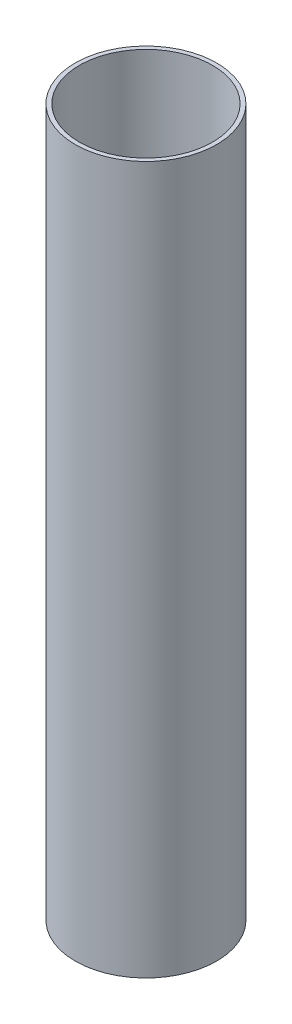
ISO-10303-21;
HEADER;
FILE_DESCRIPTION(('STEP AP214'),'2;1');
FILE_NAME('part.step','',(''),(''),'','','');
FILE_SCHEMA(('AUTOMOTIVE_DESIGN { 1 0 10303 214 1 1 1 1 }'));
ENDSEC;
DATA;
#1=APPLICATION_CONTEXT('core data for automotive mechanical design processes');
#2=APPLICATION_PROTOCOL_DEFINITION('international standard','automotive_design',2000,#1);
#3=PRODUCT_CONTEXT('',#1,'mechanical');
#4=PRODUCT('Part','Part','',(#3));
#5=PRODUCT_RELATED_PRODUCT_CATEGORY('part','',(#4));
#6=PRODUCT_DEFINITION_FORMATION('','',#4);
#7=PRODUCT_DEFINITION_CONTEXT('part definition',#1,'design');
#8=PRODUCT_DEFINITION('design','',#6,#7);
#9=PRODUCT_DEFINITION_SHAPE('','',#8);
#10=(LENGTH_UNIT() NAMED_UNIT(*) SI_UNIT(.MILLI.,.METRE.));
#11=(NAMED_UNIT(*) PLANE_ANGLE_UNIT() SI_UNIT($,.RADIAN.));
#12=(NAMED_UNIT(*) SI_UNIT($,.STERADIAN.) SOLID_ANGLE_UNIT());
#13=UNCERTAINTY_MEASURE_WITH_UNIT(LENGTH_MEASURE(1.E-05),#10,'distance_accuracy_value','');
#14=(GEOMETRIC_REPRESENTATION_CONTEXT(3) GLOBAL_UNCERTAINTY_ASSIGNED_CONTEXT((#13)) GLOBAL_UNIT_ASSIGNED_CONTEXT((#10,
#11,#12)) REPRESENTATION_CONTEXT('',''));
#15=CARTESIAN_POINT('',(0.,0.,0.));
#16=DIRECTION('',(0.,0.,1.));
#17=DIRECTION('',(1.,0.,0.));
#18=AXIS2_PLACEMENT_3D('',#15,#16,#17);
#19=CARTESIAN_POINT('',(0.,0.,0.));
#20=DIRECTION('',(0.,1.,0.));
#21=DIRECTION('',(0.,0.,1.));
#22=AXIS2_PLACEMENT_3D('',#19,#20,#21);
#23=CYLINDRICAL_SURFACE('',#22,6.35);
#24=CARTESIAN_POINT('',(0.,63.5,0.));
#25=DIRECTION('',(0.,1.,0.));
#26=DIRECTION('',(0.,0.,1.));
#27=AXIS2_PLACEMENT_3D('',#24,#25,#26);
#28=CIRCLE('',#27,6.35);
#29=CARTESIAN_POINT('',(0.,63.5,6.35));
#30=VERTEX_POINT('',#29);
#31=EDGE_CURVE('E44',#30,#30,#28,.T.);
#32=ORIENTED_EDGE('',*,*,#31,.F.);
#33=EDGE_LOOP('',(#32));
#34=FACE_BOUND('',#33,.T.);
#35=CARTESIAN_POINT('',(0.,0.,0.));
#36=DIRECTION('',(0.,1.,0.));
#37=DIRECTION('',(0.,0.,1.));
#38=AXIS2_PLACEMENT_3D('',#35,#36,#37);
#39=CIRCLE('',#38,6.35);
#40=CARTESIAN_POINT('',(0.,0.,6.35));
#41=VERTEX_POINT('',#40);
#42=EDGE_CURVE('E35',#41,#41,#39,.T.);
#43=ORIENTED_EDGE('',*,*,#42,.T.);
#44=EDGE_LOOP('',(#43));
#45=FACE_BOUND('',#44,.T.);
#46=ADVANCED_FACE('F32',(#34,#45),#23,.T.);
#47=CARTESIAN_POINT('',(0.,0.,0.));
#48=DIRECTION('',(0.,1.,0.));
#49=DIRECTION('',(0.,0.,1.));
#50=AXIS2_PLACEMENT_3D('',#47,#48,#49);
#51=PLANE('',#50);
#52=CARTESIAN_POINT('',(0.,0.,0.));
#53=DIRECTION('',(0.,1.,0.));
#54=DIRECTION('',(0.,0.,1.));
#55=AXIS2_PLACEMENT_3D('',#52,#53,#54);
#56=CIRCLE('',#55,5.98048882984768);
#57=CARTESIAN_POINT('',(0.,0.,5.98048882984768));
#58=VERTEX_POINT('',#57);
#59=EDGE_CURVE('E39',#58,#58,#56,.F.);
#60=ORIENTED_EDGE('',*,*,#59,.F.);
#61=EDGE_LOOP('',(#60));
#62=FACE_BOUND('',#61,.T.);
#63=ORIENTED_EDGE('',*,*,#42,.F.);
#64=EDGE_LOOP('',(#63));
#65=FACE_BOUND('',#64,.T.);
#66=ADVANCED_FACE('F53',(#62,#65),#51,.F.);
#67=CARTESIAN_POINT('',(0.,63.5,0.));
#68=DIRECTION('',(0.,1.,0.));
#69=DIRECTION('',(0.,0.,1.));
#70=AXIS2_PLACEMENT_3D('',#67,#68,#69);
#71=PLANE('',#70);
#72=CARTESIAN_POINT('',(0.,63.5,0.));
#73=DIRECTION('',(0.,1.,0.));
#74=DIRECTION('',(0.,0.,1.));
#75=AXIS2_PLACEMENT_3D('',#72,#73,#74);
#76=CIRCLE('',#75,5.98048882984768);
#77=CARTESIAN_POINT('',(0.,63.5,5.98048882984768));
#78=VERTEX_POINT('',#77);
#79=EDGE_CURVE('E10',#78,#78,#76,.F.);
#80=ORIENTED_EDGE('',*,*,#79,.T.);
#81=EDGE_LOOP('',(#80));
#82=FACE_BOUND('',#81,.T.);
#83=ORIENTED_EDGE('',*,*,#31,.T.);
#84=EDGE_LOOP('',(#83));
#85=FACE_BOUND('',#84,.T.);
#86=ADVANCED_FACE('F55',(#82,#85),#71,.T.);
#87=CARTESIAN_POINT('',(0.,0.,0.));
#88=DIRECTION('',(0.,1.,0.));
#89=DIRECTION('',(0.,0.,1.));
#90=AXIS2_PLACEMENT_3D('',#87,#88,#89);
#91=CYLINDRICAL_SURFACE('',#90,5.98048882984768);
#92=ORIENTED_EDGE('',*,*,#79,.F.);
#93=EDGE_LOOP('',(#92));
#94=FACE_BOUND('',#93,.T.);
#95=ORIENTED_EDGE('',*,*,#59,.T.);
#96=EDGE_LOOP('',(#95));
#97=FACE_BOUND('',#96,.T.);
#98=ADVANCED_FACE('F61',(#94,#97),#91,.F.);
#99=CLOSED_SHELL('',(#46,#66,#86,#98));
#100=MANIFOLD_SOLID_BREP('B2',#99);
#101=ADVANCED_BREP_SHAPE_REPRESENTATION('',(#18,#100),#14);
#102=SHAPE_DEFINITION_REPRESENTATION(#9,#101);
ENDSEC;
END-ISO-10303-21;
